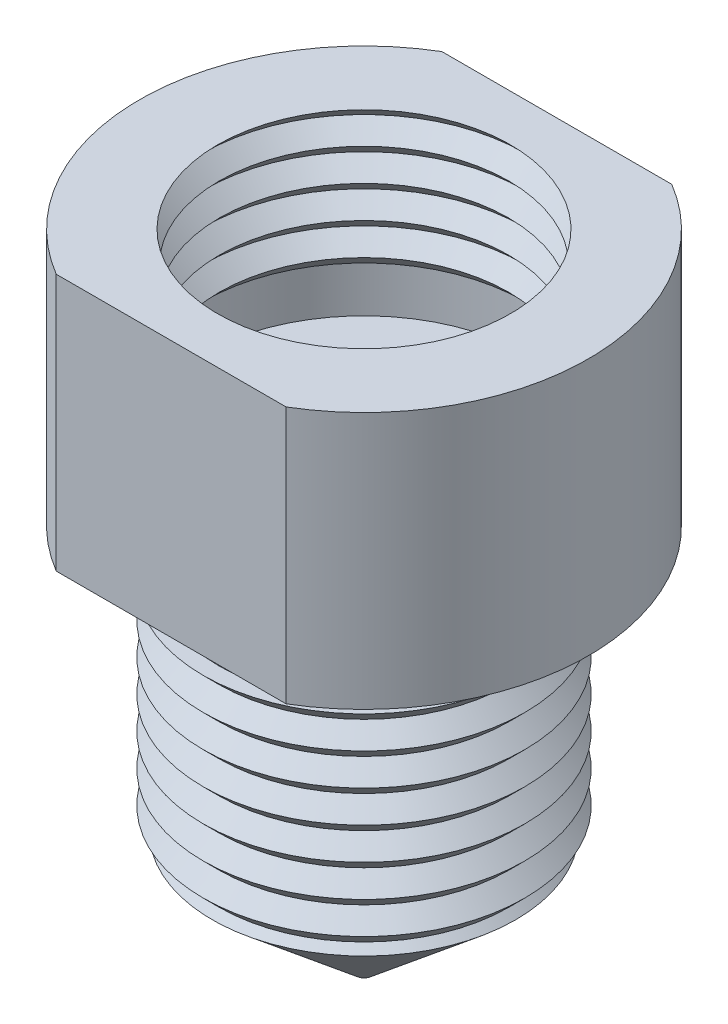
ISO-10303-21;
HEADER;
FILE_DESCRIPTION(('STEP AP214'),'2;1');
FILE_NAME('part.step','',(''),(''),'','','');
FILE_SCHEMA(('AUTOMOTIVE_DESIGN { 1 0 10303 214 1 1 1 1 }'));
ENDSEC;
DATA;
#1=APPLICATION_CONTEXT('core data for automotive mechanical design processes');
#2=APPLICATION_PROTOCOL_DEFINITION('international standard','automotive_design',2000,#1);
#3=PRODUCT_CONTEXT('',#1,'mechanical');
#4=PRODUCT('Part','Part','',(#3));
#5=PRODUCT_RELATED_PRODUCT_CATEGORY('part','',(#4));
#6=PRODUCT_DEFINITION_FORMATION('','',#4);
#7=PRODUCT_DEFINITION_CONTEXT('part definition',#1,'design');
#8=PRODUCT_DEFINITION('design','',#6,#7);
#9=PRODUCT_DEFINITION_SHAPE('','',#8);
#10=(LENGTH_UNIT() NAMED_UNIT(*) SI_UNIT(.MILLI.,.METRE.));
#11=(NAMED_UNIT(*) PLANE_ANGLE_UNIT() SI_UNIT($,.RADIAN.));
#12=(NAMED_UNIT(*) SI_UNIT($,.STERADIAN.) SOLID_ANGLE_UNIT());
#13=UNCERTAINTY_MEASURE_WITH_UNIT(LENGTH_MEASURE(1.E-05),#10,'distance_accuracy_value','');
#14=(GEOMETRIC_REPRESENTATION_CONTEXT(3) GLOBAL_UNCERTAINTY_ASSIGNED_CONTEXT((#13)) GLOBAL_UNIT_ASSIGNED_CONTEXT((#10,
#11,#12)) REPRESENTATION_CONTEXT('',''));
#15=CARTESIAN_POINT('',(0.,0.,0.));
#16=DIRECTION('',(0.,0.,1.));
#17=DIRECTION('',(1.,0.,0.));
#18=AXIS2_PLACEMENT_3D('',#15,#16,#17);
#19=CARTESIAN_POINT('',(6.985,0.,0.));
#20=DIRECTION('',(0.,-1.,0.));
#21=DIRECTION('',(1.,0.,0.));
#22=AXIS2_PLACEMENT_3D('',#19,#20,#21);
#23=PLANE('',#22);
#24=CARTESIAN_POINT('',(0.,0.,0.));
#25=DIRECTION('',(0.,1.,0.));
#26=DIRECTION('',(-1.,0.,0.));
#27=AXIS2_PLACEMENT_3D('',#24,#25,#26);
#28=CIRCLE('',#27,4.55499999999999);
#29=CARTESIAN_POINT('',(-4.55499999999999,0.,0.));
#30=VERTEX_POINT('',#29);
#31=EDGE_CURVE('E95',#30,#30,#28,.T.);
#32=ORIENTED_EDGE('',*,*,#31,.F.);
#33=EDGE_LOOP('',(#32));
#34=FACE_BOUND('',#33,.T.);
#35=DIRECTION('',(-1.,0.,0.));
#36=VECTOR('',#35,1.);
#37=CARTESIAN_POINT('',(-10.2758672415715,0.,-6.));
#38=LINE('',#37,#36);
#39=CARTESIAN_POINT('',(3.57634240530741,0.,-6.));
#40=VERTEX_POINT('',#39);
#41=CARTESIAN_POINT('',(-3.57634240530741,0.,-6.));
#42=VERTEX_POINT('',#41);
#43=EDGE_CURVE('E80',#40,#42,#38,.T.);
#44=ORIENTED_EDGE('',*,*,#43,.T.);
#45=CARTESIAN_POINT('',(0.,0.,0.));
#46=DIRECTION('',(0.,1.,0.));
#47=DIRECTION('',(-1.,0.,0.));
#48=AXIS2_PLACEMENT_3D('',#45,#46,#47);
#49=CIRCLE('',#48,6.985);
#50=CARTESIAN_POINT('',(-3.57634240530741,0.,6.));
#51=VERTEX_POINT('',#50);
#52=EDGE_CURVE('E87',#42,#51,#49,.T.);
#53=ORIENTED_EDGE('',*,*,#52,.T.);
#54=DIRECTION('',(1.,0.,0.));
#55=VECTOR('',#54,1.);
#56=CARTESIAN_POINT('',(-10.2758672415715,0.,6.));
#57=LINE('',#56,#55);
#58=CARTESIAN_POINT('',(3.57634240530741,0.,6.));
#59=VERTEX_POINT('',#58);
#60=EDGE_CURVE('E72',#51,#59,#57,.T.);
#61=ORIENTED_EDGE('',*,*,#60,.T.);
#62=EDGE_CURVE('E92',#59,#40,#49,.T.);
#63=ORIENTED_EDGE('',*,*,#62,.T.);
#64=EDGE_LOOP('',(#44,#53,#61,#63));
#65=FACE_BOUND('',#64,.T.);
#66=ADVANCED_FACE('F34',(#34,#65),#23,.F.);
#67=CARTESIAN_POINT('',(0.,0.,0.));
#68=DIRECTION('',(0.,1.,0.));
#69=DIRECTION('',(-1.,0.,0.));
#70=AXIS2_PLACEMENT_3D('',#67,#68,#69);
#71=CYLINDRICAL_SURFACE('',#70,6.985);
#72=DIRECTION('',(0.,1.,0.));
#73=VECTOR('',#72,1.);
#74=CARTESIAN_POINT('',(-3.57634240530741,0.,-6.));
#75=LINE('',#74,#73);
#76=CARTESIAN_POINT('',(-3.57634240530741,-8.001,-6.));
#77=VERTEX_POINT('',#76);
#78=EDGE_CURVE('E144',#77,#42,#75,.T.);
#79=ORIENTED_EDGE('',*,*,#78,.F.);
#80=CARTESIAN_POINT('',(0.,-8.001,0.));
#81=DIRECTION('',(0.,1.,0.));
#82=DIRECTION('',(-1.,0.,0.));
#83=AXIS2_PLACEMENT_3D('',#80,#81,#82);
#84=CIRCLE('',#83,6.985);
#85=CARTESIAN_POINT('',(-3.57634240530741,-8.001,6.));
#86=VERTEX_POINT('',#85);
#87=EDGE_CURVE('E89',#77,#86,#84,.T.);
#88=ORIENTED_EDGE('',*,*,#87,.T.);
#89=DIRECTION('',(0.,1.,0.));
#90=VECTOR('',#89,1.);
#91=CARTESIAN_POINT('',(-3.57634240530741,0.,6.));
#92=LINE('',#91,#90);
#93=EDGE_CURVE('E56',#51,#86,#92,.F.);
#94=ORIENTED_EDGE('',*,*,#93,.F.);
#95=ORIENTED_EDGE('',*,*,#52,.F.);
#96=EDGE_LOOP('',(#79,#88,#94,#95));
#97=FACE_BOUND('',#96,.T.);
#98=ADVANCED_FACE('F86',(#97),#71,.T.);
#99=DIRECTION('',(0.,1.,0.));
#100=VECTOR('',#99,1.);
#101=CARTESIAN_POINT('',(3.57634240530741,0.,-6.));
#102=LINE('',#101,#100);
#103=CARTESIAN_POINT('',(3.57634240530741,-8.001,-6.));
#104=VERTEX_POINT('',#103);
#105=EDGE_CURVE('E48',#40,#104,#102,.F.);
#106=ORIENTED_EDGE('',*,*,#105,.F.);
#107=ORIENTED_EDGE('',*,*,#62,.F.);
#108=DIRECTION('',(0.,1.,0.));
#109=VECTOR('',#108,1.);
#110=CARTESIAN_POINT('',(3.57634240530741,0.,6.));
#111=LINE('',#110,#109);
#112=CARTESIAN_POINT('',(3.57634240530741,-8.001,6.));
#113=VERTEX_POINT('',#112);
#114=EDGE_CURVE('E75',#113,#59,#111,.T.);
#115=ORIENTED_EDGE('',*,*,#114,.F.);
#116=EDGE_CURVE('E93',#113,#104,#84,.T.);
#117=ORIENTED_EDGE('',*,*,#116,.T.);
#118=EDGE_LOOP('',(#106,#107,#115,#117));
#119=FACE_BOUND('',#118,.T.);
#120=ADVANCED_FACE('F140',(#119),#71,.T.);
#121=CARTESIAN_POINT('',(4.5,-8.001,0.));
#122=DIRECTION('',(0.,1.,0.));
#123=DIRECTION('',(-1.,0.,0.));
#124=AXIS2_PLACEMENT_3D('',#121,#122,#123);
#125=PLANE('',#124);
#126=CARTESIAN_POINT('',(0.,-8.001,0.));
#127=DIRECTION('',(0.,1.,0.));
#128=DIRECTION('',(-1.,0.,0.));
#129=AXIS2_PLACEMENT_3D('',#126,#127,#128);
#130=CIRCLE('',#129,4.5);
#131=CARTESIAN_POINT('',(-4.5,-8.001,0.));
#132=VERTEX_POINT('',#131);
#133=EDGE_CURVE('E204',#132,#132,#130,.T.);
#134=ORIENTED_EDGE('',*,*,#133,.T.);
#135=EDGE_LOOP('',(#134));
#136=FACE_BOUND('',#135,.T.);
#137=DIRECTION('',(-1.,0.,0.));
#138=VECTOR('',#137,1.);
#139=CARTESIAN_POINT('',(4.5,-8.001,-6.));
#140=LINE('',#139,#138);
#141=EDGE_CURVE('E12',#104,#77,#140,.T.);
#142=ORIENTED_EDGE('',*,*,#141,.F.);
#143=ORIENTED_EDGE('',*,*,#116,.F.);
#144=DIRECTION('',(1.,0.,0.));
#145=VECTOR('',#144,1.);
#146=CARTESIAN_POINT('',(4.5,-8.001,6.));
#147=LINE('',#146,#145);
#148=EDGE_CURVE('E42',#86,#113,#147,.T.);
#149=ORIENTED_EDGE('',*,*,#148,.F.);
#150=ORIENTED_EDGE('',*,*,#87,.F.);
#151=EDGE_LOOP('',(#142,#143,#149,#150));
#152=FACE_BOUND('',#151,.T.);
#153=ADVANCED_FACE('F142',(#136,#152),#125,.F.);
#154=CARTESIAN_POINT('',(0.,0.,0.));
#155=DIRECTION('',(0.,1.,0.));
#156=DIRECTION('',(-1.,0.,0.));
#157=AXIS2_PLACEMENT_3D('',#154,#155,#156);
#158=CYLINDRICAL_SURFACE('',#157,1.5875);
#159=CARTESIAN_POINT('',(0.,-17.9060295699052,0.));
#160=DIRECTION('',(0.,1.,0.));
#161=DIRECTION('',(-1.,0.,0.));
#162=AXIS2_PLACEMENT_3D('',#159,#160,#161);
#163=CIRCLE('',#162,1.5875);
#164=CARTESIAN_POINT('',(-1.5875,-17.9060295699052,0.));
#165=VERTEX_POINT('',#164);
#166=EDGE_CURVE('E145',#165,#165,#163,.T.);
#167=ORIENTED_EDGE('',*,*,#166,.F.);
#168=EDGE_LOOP('',(#167));
#169=FACE_BOUND('',#168,.T.);
#170=CARTESIAN_POINT('',(0.,-5.969,0.));
#171=DIRECTION('',(0.,1.,0.));
#172=DIRECTION('',(-1.,0.,0.));
#173=AXIS2_PLACEMENT_3D('',#170,#171,#172);
#174=CIRCLE('',#173,1.5875);
#175=CARTESIAN_POINT('',(-1.5875,-5.969,0.));
#176=VERTEX_POINT('',#175);
#177=EDGE_CURVE('E135',#176,#176,#174,.T.);
#178=ORIENTED_EDGE('',*,*,#177,.T.);
#179=EDGE_LOOP('',(#178));
#180=FACE_BOUND('',#179,.T.);
#181=ADVANCED_FACE('F36',(#169,#180),#158,.F.);
#182=CARTESIAN_POINT('',(5.1435,-5.969,0.));
#183=DIRECTION('',(0.,-1.,0.));
#184=DIRECTION('',(1.,0.,0.));
#185=AXIS2_PLACEMENT_3D('',#182,#183,#184);
#186=PLANE('',#185);
#187=ORIENTED_EDGE('',*,*,#177,.F.);
#188=EDGE_LOOP('',(#187));
#189=FACE_BOUND('',#188,.T.);
#190=CARTESIAN_POINT('',(0.,-5.969,0.));
#191=DIRECTION('',(0.,1.,0.));
#192=DIRECTION('',(-1.,0.,0.));
#193=AXIS2_PLACEMENT_3D('',#190,#191,#192);
#194=CIRCLE('',#193,5.1435);
#195=CARTESIAN_POINT('',(-5.1435,-5.969,0.));
#196=VERTEX_POINT('',#195);
#197=EDGE_CURVE('E132',#196,#196,#194,.T.);
#198=ORIENTED_EDGE('',*,*,#197,.T.);
#199=EDGE_LOOP('',(#198));
#200=FACE_BOUND('',#199,.T.);
#201=ADVANCED_FACE('F326',(#189,#200),#186,.F.);
#202=CARTESIAN_POINT('',(0.,0.,0.));
#203=DIRECTION('',(0.,1.,0.));
#204=DIRECTION('',(-1.,0.,0.));
#205=AXIS2_PLACEMENT_3D('',#202,#203,#204);
#206=CYLINDRICAL_SURFACE('',#205,5.1435);
#207=ORIENTED_EDGE('',*,*,#197,.F.);
#208=EDGE_LOOP('',(#207));
#209=FACE_BOUND('',#208,.T.);
#210=CARTESIAN_POINT('',(0.,-4.445,0.));
#211=DIRECTION('',(0.,1.,0.));
#212=DIRECTION('',(-1.,0.,0.));
#213=AXIS2_PLACEMENT_3D('',#210,#211,#212);
#214=CIRCLE('',#213,5.1435);
#215=CARTESIAN_POINT('',(-5.1435,-4.445,0.));
#216=VERTEX_POINT('',#215);
#217=EDGE_CURVE('E129',#216,#216,#214,.T.);
#218=ORIENTED_EDGE('',*,*,#217,.T.);
#219=EDGE_LOOP('',(#218));
#220=FACE_BOUND('',#219,.T.);
#221=ADVANCED_FACE('F331',(#209,#220),#206,.F.);
#222=CARTESIAN_POINT('',(5.,-4.445,0.));
#223=DIRECTION('',(0.,1.,0.));
#224=DIRECTION('',(-1.,0.,0.));
#225=AXIS2_PLACEMENT_3D('',#222,#223,#224);
#226=PLANE('',#225);
#227=ORIENTED_EDGE('',*,*,#217,.F.);
#228=EDGE_LOOP('',(#227));
#229=FACE_BOUND('',#228,.T.);
#230=CARTESIAN_POINT('',(0.,-4.445,0.));
#231=DIRECTION('',(0.,1.,0.));
#232=DIRECTION('',(-1.,0.,0.));
#233=AXIS2_PLACEMENT_3D('',#230,#231,#232);
#234=CIRCLE('',#233,5.);
#235=CARTESIAN_POINT('',(-5.,-4.445,0.));
#236=VERTEX_POINT('',#235);
#237=EDGE_CURVE('E126',#236,#236,#234,.T.);
#238=ORIENTED_EDGE('',*,*,#237,.T.);
#239=EDGE_LOOP('',(#238));
#240=FACE_BOUND('',#239,.T.);
#241=ADVANCED_FACE('F336',(#229,#240),#226,.F.);
#242=CARTESIAN_POINT('',(0.,-3.94500000000001,0.));
#243=DIRECTION('',(0.,-1.,0.));
#244=DIRECTION('',(1.,0.,0.));
#245=AXIS2_PLACEMENT_3D('',#242,#243,#244);
#246=CONICAL_SURFACE('',#245,4.5,0.78539816339746);
#247=ORIENTED_EDGE('',*,*,#237,.F.);
#248=EDGE_LOOP('',(#247));
#249=FACE_BOUND('',#248,.T.);
#250=CARTESIAN_POINT('',(0.,-3.94500000000001,0.));
#251=DIRECTION('',(0.,1.,0.));
#252=DIRECTION('',(-1.,0.,0.));
#253=AXIS2_PLACEMENT_3D('',#250,#251,#252);
#254=CIRCLE('',#253,4.5);
#255=CARTESIAN_POINT('',(-4.5,-3.94500000000001,0.));
#256=VERTEX_POINT('',#255);
#257=EDGE_CURVE('E123',#256,#256,#254,.T.);
#258=ORIENTED_EDGE('',*,*,#257,.T.);
#259=EDGE_LOOP('',(#258));
#260=FACE_BOUND('',#259,.T.);
#261=ADVANCED_FACE('F342',(#249,#260),#246,.F.);
#262=CARTESIAN_POINT('',(0.,-3.445,0.));
#263=DIRECTION('',(0.,1.,0.));
#264=DIRECTION('',(-1.,0.,0.));
#265=AXIS2_PLACEMENT_3D('',#262,#263,#264);
#266=CONICAL_SURFACE('',#265,5.,0.785398163397438);
#267=ORIENTED_EDGE('',*,*,#257,.F.);
#268=EDGE_LOOP('',(#267));
#269=FACE_BOUND('',#268,.T.);
#270=CARTESIAN_POINT('',(0.,-3.445,0.));
#271=DIRECTION('',(0.,1.,0.));
#272=DIRECTION('',(-1.,0.,0.));
#273=AXIS2_PLACEMENT_3D('',#270,#271,#272);
#274=CIRCLE('',#273,5.);
#275=CARTESIAN_POINT('',(-5.,-3.445,0.));
#276=VERTEX_POINT('',#275);
#277=EDGE_CURVE('E120',#276,#276,#274,.T.);
#278=ORIENTED_EDGE('',*,*,#277,.T.);
#279=EDGE_LOOP('',(#278));
#280=FACE_BOUND('',#279,.T.);
#281=ADVANCED_FACE('F348',(#269,#280),#266,.F.);
#282=CARTESIAN_POINT('',(0.,-2.94500000000001,0.));
#283=DIRECTION('',(0.,-1.,0.));
#284=DIRECTION('',(1.,0.,0.));
#285=AXIS2_PLACEMENT_3D('',#282,#283,#284);
#286=CONICAL_SURFACE('',#285,4.5,0.785398163397458);
#287=ORIENTED_EDGE('',*,*,#277,.F.);
#288=EDGE_LOOP('',(#287));
#289=FACE_BOUND('',#288,.T.);
#290=CARTESIAN_POINT('',(0.,-2.94500000000001,0.));
#291=DIRECTION('',(0.,1.,0.));
#292=DIRECTION('',(-1.,0.,0.));
#293=AXIS2_PLACEMENT_3D('',#290,#291,#292);
#294=CIRCLE('',#293,4.5);
#295=CARTESIAN_POINT('',(-4.5,-2.94500000000001,0.));
#296=VERTEX_POINT('',#295);
#297=EDGE_CURVE('E117',#296,#296,#294,.T.);
#298=ORIENTED_EDGE('',*,*,#297,.T.);
#299=EDGE_LOOP('',(#298));
#300=FACE_BOUND('',#299,.T.);
#301=ADVANCED_FACE('F354',(#289,#300),#286,.F.);
#302=CARTESIAN_POINT('',(0.,-2.445,0.));
#303=DIRECTION('',(0.,1.,0.));
#304=DIRECTION('',(-1.,0.,0.));
#305=AXIS2_PLACEMENT_3D('',#302,#303,#304);
#306=CONICAL_SURFACE('',#305,5.,0.785398163397438);
#307=ORIENTED_EDGE('',*,*,#297,.F.);
#308=EDGE_LOOP('',(#307));
#309=FACE_BOUND('',#308,.T.);
#310=CARTESIAN_POINT('',(0.,-2.445,0.));
#311=DIRECTION('',(0.,1.,0.));
#312=DIRECTION('',(-1.,0.,0.));
#313=AXIS2_PLACEMENT_3D('',#310,#311,#312);
#314=CIRCLE('',#313,5.);
#315=CARTESIAN_POINT('',(-5.,-2.445,0.));
#316=VERTEX_POINT('',#315);
#317=EDGE_CURVE('E114',#316,#316,#314,.T.);
#318=ORIENTED_EDGE('',*,*,#317,.T.);
#319=EDGE_LOOP('',(#318));
#320=FACE_BOUND('',#319,.T.);
#321=ADVANCED_FACE('F360',(#309,#320),#306,.F.);
#322=CARTESIAN_POINT('',(0.,-1.94500000000001,0.));
#323=DIRECTION('',(0.,-1.,0.));
#324=DIRECTION('',(1.,0.,0.));
#325=AXIS2_PLACEMENT_3D('',#322,#323,#324);
#326=CONICAL_SURFACE('',#325,4.5,0.78539816339746);
#327=ORIENTED_EDGE('',*,*,#317,.F.);
#328=EDGE_LOOP('',(#327));
#329=FACE_BOUND('',#328,.T.);
#330=CARTESIAN_POINT('',(0.,-1.94500000000001,0.));
#331=DIRECTION('',(0.,1.,0.));
#332=DIRECTION('',(-1.,0.,0.));
#333=AXIS2_PLACEMENT_3D('',#330,#331,#332);
#334=CIRCLE('',#333,4.5);
#335=CARTESIAN_POINT('',(-4.5,-1.94500000000001,0.));
#336=VERTEX_POINT('',#335);
#337=EDGE_CURVE('E111',#336,#336,#334,.T.);
#338=ORIENTED_EDGE('',*,*,#337,.T.);
#339=EDGE_LOOP('',(#338));
#340=FACE_BOUND('',#339,.T.);
#341=ADVANCED_FACE('F366',(#329,#340),#326,.F.);
#342=CARTESIAN_POINT('',(0.,-1.445,0.));
#343=DIRECTION('',(0.,1.,0.));
#344=DIRECTION('',(-1.,0.,0.));
#345=AXIS2_PLACEMENT_3D('',#342,#343,#344);
#346=CONICAL_SURFACE('',#345,5.,0.785398163397438);
#347=ORIENTED_EDGE('',*,*,#337,.F.);
#348=EDGE_LOOP('',(#347));
#349=FACE_BOUND('',#348,.T.);
#350=CARTESIAN_POINT('',(0.,-1.445,0.));
#351=DIRECTION('',(0.,1.,0.));
#352=DIRECTION('',(-1.,0.,0.));
#353=AXIS2_PLACEMENT_3D('',#350,#351,#352);
#354=CIRCLE('',#353,5.);
#355=CARTESIAN_POINT('',(-5.,-1.445,0.));
#356=VERTEX_POINT('',#355);
#357=EDGE_CURVE('E108',#356,#356,#354,.T.);
#358=ORIENTED_EDGE('',*,*,#357,.T.);
#359=EDGE_LOOP('',(#358));
#360=FACE_BOUND('',#359,.T.);
#361=ADVANCED_FACE('F372',(#349,#360),#346,.F.);
#362=CARTESIAN_POINT('',(0.,-0.945000000000014,0.));
#363=DIRECTION('',(0.,-1.,0.));
#364=DIRECTION('',(1.,0.,0.));
#365=AXIS2_PLACEMENT_3D('',#362,#363,#364);
#366=CONICAL_SURFACE('',#365,4.5,0.785398163397458);
#367=ORIENTED_EDGE('',*,*,#357,.F.);
#368=EDGE_LOOP('',(#367));
#369=FACE_BOUND('',#368,.T.);
#370=CARTESIAN_POINT('',(0.,-0.945000000000014,0.));
#371=DIRECTION('',(0.,1.,0.));
#372=DIRECTION('',(-1.,0.,0.));
#373=AXIS2_PLACEMENT_3D('',#370,#371,#372);
#374=CIRCLE('',#373,4.5);
#375=CARTESIAN_POINT('',(-4.5,-0.945000000000014,0.));
#376=VERTEX_POINT('',#375);
#377=EDGE_CURVE('E105',#376,#376,#374,.T.);
#378=ORIENTED_EDGE('',*,*,#377,.T.);
#379=EDGE_LOOP('',(#378));
#380=FACE_BOUND('',#379,.T.);
#381=ADVANCED_FACE('F378',(#369,#380),#366,.F.);
#382=CARTESIAN_POINT('',(0.,-0.445000000000004,0.));
#383=DIRECTION('',(0.,1.,0.));
#384=DIRECTION('',(-1.,0.,0.));
#385=AXIS2_PLACEMENT_3D('',#382,#383,#384);
#386=CONICAL_SURFACE('',#385,5.,0.785398163397438);
#387=ORIENTED_EDGE('',*,*,#377,.F.);
#388=EDGE_LOOP('',(#387));
#389=FACE_BOUND('',#388,.T.);
#390=CARTESIAN_POINT('',(0.,-0.445000000000004,0.));
#391=DIRECTION('',(0.,1.,0.));
#392=DIRECTION('',(-1.,0.,0.));
#393=AXIS2_PLACEMENT_3D('',#390,#391,#392);
#394=CIRCLE('',#393,5.);
#395=CARTESIAN_POINT('',(-5.,-0.445000000000005,0.));
#396=VERTEX_POINT('',#395);
#397=EDGE_CURVE('E102',#396,#396,#394,.T.);
#398=ORIENTED_EDGE('',*,*,#397,.T.);
#399=EDGE_LOOP('',(#398));
#400=FACE_BOUND('',#399,.T.);
#401=ADVANCED_FACE('F384',(#389,#400),#386,.F.);
#402=CARTESIAN_POINT('',(0.,0.,0.));
#403=DIRECTION('',(0.,-1.,0.));
#404=DIRECTION('',(1.,0.,0.));
#405=AXIS2_PLACEMENT_3D('',#402,#403,#404);
#406=CONICAL_SURFACE('',#405,4.55499999999999,0.785398163397459);
#407=ORIENTED_EDGE('',*,*,#397,.F.);
#408=EDGE_LOOP('',(#407));
#409=FACE_BOUND('',#408,.T.);
#410=ORIENTED_EDGE('',*,*,#31,.T.);
#411=EDGE_LOOP('',(#410));
#412=FACE_BOUND('',#411,.T.);
#413=ADVANCED_FACE('F213',(#409,#412),#406,.F.);
#414=CARTESIAN_POINT('',(0.,0.,0.));
#415=DIRECTION('',(0.,1.,0.));
#416=DIRECTION('',(-1.,0.,0.));
#417=AXIS2_PLACEMENT_3D('',#414,#415,#416);
#418=CYLINDRICAL_SURFACE('',#417,4.5);
#419=ORIENTED_EDGE('',*,*,#133,.F.);
#420=EDGE_LOOP('',(#419));
#421=FACE_BOUND('',#420,.T.);
#422=CARTESIAN_POINT('',(0.,-9.525,0.));
#423=DIRECTION('',(0.,1.,0.));
#424=DIRECTION('',(-1.,0.,0.));
#425=AXIS2_PLACEMENT_3D('',#422,#423,#424);
#426=CIRCLE('',#425,4.5);
#427=CARTESIAN_POINT('',(-4.5,-9.525,0.));
#428=VERTEX_POINT('',#427);
#429=EDGE_CURVE('E202',#428,#428,#426,.T.);
#430=ORIENTED_EDGE('',*,*,#429,.T.);
#431=EDGE_LOOP('',(#430));
#432=FACE_BOUND('',#431,.T.);
#433=ADVANCED_FACE('F209',(#421,#432),#418,.T.);
#434=CARTESIAN_POINT('',(5.,-9.525,0.));
#435=DIRECTION('',(0.,-1.,0.));
#436=DIRECTION('',(1.,0.,0.));
#437=AXIS2_PLACEMENT_3D('',#434,#435,#436);
#438=PLANE('',#437);
#439=ORIENTED_EDGE('',*,*,#429,.F.);
#440=EDGE_LOOP('',(#439));
#441=FACE_BOUND('',#440,.T.);
#442=CARTESIAN_POINT('',(0.,-9.525,0.));
#443=DIRECTION('',(0.,1.,0.));
#444=DIRECTION('',(-1.,0.,0.));
#445=AXIS2_PLACEMENT_3D('',#442,#443,#444);
#446=CIRCLE('',#445,5.);
#447=CARTESIAN_POINT('',(-5.,-9.525,0.));
#448=VERTEX_POINT('',#447);
#449=EDGE_CURVE('E199',#448,#448,#446,.T.);
#450=ORIENTED_EDGE('',*,*,#449,.T.);
#451=EDGE_LOOP('',(#450));
#452=FACE_BOUND('',#451,.T.);
#453=ADVANCED_FACE('F212',(#441,#452),#438,.F.);
#454=CARTESIAN_POINT('',(0.,-10.025,0.));
#455=DIRECTION('',(0.,1.,0.));
#456=DIRECTION('',(-1.,0.,0.));
#457=AXIS2_PLACEMENT_3D('',#454,#455,#456);
#458=CONICAL_SURFACE('',#457,4.5,0.785398163397439);
#459=ORIENTED_EDGE('',*,*,#449,.F.);
#460=EDGE_LOOP('',(#459));
#461=FACE_BOUND('',#460,.T.);
#462=CARTESIAN_POINT('',(0.,-10.025,0.));
#463=DIRECTION('',(0.,1.,0.));
#464=DIRECTION('',(-1.,0.,0.));
#465=AXIS2_PLACEMENT_3D('',#462,#463,#464);
#466=CIRCLE('',#465,4.5);
#467=CARTESIAN_POINT('',(-4.5,-10.025,0.));
#468=VERTEX_POINT('',#467);
#469=EDGE_CURVE('E196',#468,#468,#466,.T.);
#470=ORIENTED_EDGE('',*,*,#469,.T.);
#471=EDGE_LOOP('',(#470));
#472=FACE_BOUND('',#471,.T.);
#473=ADVANCED_FACE('F219',(#461,#472),#458,.T.);
#474=CARTESIAN_POINT('',(0.,-10.525,0.));
#475=DIRECTION('',(0.,-1.,0.));
#476=DIRECTION('',(1.,0.,0.));
#477=AXIS2_PLACEMENT_3D('',#474,#475,#476);
#478=CONICAL_SURFACE('',#477,5.,0.78539816339746);
#479=ORIENTED_EDGE('',*,*,#469,.F.);
#480=EDGE_LOOP('',(#479));
#481=FACE_BOUND('',#480,.T.);
#482=CARTESIAN_POINT('',(0.,-10.525,0.));
#483=DIRECTION('',(0.,1.,0.));
#484=DIRECTION('',(-1.,0.,0.));
#485=AXIS2_PLACEMENT_3D('',#482,#483,#484);
#486=CIRCLE('',#485,5.);
#487=CARTESIAN_POINT('',(-5.,-10.525,0.));
#488=VERTEX_POINT('',#487);
#489=EDGE_CURVE('E193',#488,#488,#486,.T.);
#490=ORIENTED_EDGE('',*,*,#489,.T.);
#491=EDGE_LOOP('',(#490));
#492=FACE_BOUND('',#491,.T.);
#493=ADVANCED_FACE('F225',(#481,#492),#478,.T.);
#494=CARTESIAN_POINT('',(0.,-11.025,0.));
#495=DIRECTION('',(0.,1.,0.));
#496=DIRECTION('',(-1.,0.,0.));
#497=AXIS2_PLACEMENT_3D('',#494,#495,#496);
#498=CONICAL_SURFACE('',#497,4.5,0.78539816339744);
#499=ORIENTED_EDGE('',*,*,#489,.F.);
#500=EDGE_LOOP('',(#499));
#501=FACE_BOUND('',#500,.T.);
#502=CARTESIAN_POINT('',(0.,-11.025,0.));
#503=DIRECTION('',(0.,1.,0.));
#504=DIRECTION('',(-1.,0.,0.));
#505=AXIS2_PLACEMENT_3D('',#502,#503,#504);
#506=CIRCLE('',#505,4.5);
#507=CARTESIAN_POINT('',(-4.5,-11.025,0.));
#508=VERTEX_POINT('',#507);
#509=EDGE_CURVE('E190',#508,#508,#506,.T.);
#510=ORIENTED_EDGE('',*,*,#509,.T.);
#511=EDGE_LOOP('',(#510));
#512=FACE_BOUND('',#511,.T.);
#513=ADVANCED_FACE('F231',(#501,#512),#498,.T.);
#514=CARTESIAN_POINT('',(0.,-11.525,0.));
#515=DIRECTION('',(0.,-1.,0.));
#516=DIRECTION('',(1.,0.,0.));
#517=AXIS2_PLACEMENT_3D('',#514,#515,#516);
#518=CONICAL_SURFACE('',#517,5.,0.78539816339746);
#519=ORIENTED_EDGE('',*,*,#509,.F.);
#520=EDGE_LOOP('',(#519));
#521=FACE_BOUND('',#520,.T.);
#522=CARTESIAN_POINT('',(0.,-11.525,0.));
#523=DIRECTION('',(0.,1.,0.));
#524=DIRECTION('',(-1.,0.,0.));
#525=AXIS2_PLACEMENT_3D('',#522,#523,#524);
#526=CIRCLE('',#525,5.);
#527=CARTESIAN_POINT('',(-5.,-11.525,0.));
#528=VERTEX_POINT('',#527);
#529=EDGE_CURVE('E187',#528,#528,#526,.T.);
#530=ORIENTED_EDGE('',*,*,#529,.T.);
#531=EDGE_LOOP('',(#530));
#532=FACE_BOUND('',#531,.T.);
#533=ADVANCED_FACE('F237',(#521,#532),#518,.T.);
#534=CARTESIAN_POINT('',(0.,-12.025,0.));
#535=DIRECTION('',(0.,1.,0.));
#536=DIRECTION('',(-1.,0.,0.));
#537=AXIS2_PLACEMENT_3D('',#534,#535,#536);
#538=CONICAL_SURFACE('',#537,4.5,0.785398163397441);
#539=ORIENTED_EDGE('',*,*,#529,.F.);
#540=EDGE_LOOP('',(#539));
#541=FACE_BOUND('',#540,.T.);
#542=CARTESIAN_POINT('',(0.,-12.025,0.));
#543=DIRECTION('',(0.,1.,0.));
#544=DIRECTION('',(-1.,0.,0.));
#545=AXIS2_PLACEMENT_3D('',#542,#543,#544);
#546=CIRCLE('',#545,4.5);
#547=CARTESIAN_POINT('',(-4.5,-12.025,0.));
#548=VERTEX_POINT('',#547);
#549=EDGE_CURVE('E184',#548,#548,#546,.T.);
#550=ORIENTED_EDGE('',*,*,#549,.T.);
#551=EDGE_LOOP('',(#550));
#552=FACE_BOUND('',#551,.T.);
#553=ADVANCED_FACE('F243',(#541,#552),#538,.T.);
#554=CARTESIAN_POINT('',(0.,-12.525,0.));
#555=DIRECTION('',(0.,-1.,0.));
#556=DIRECTION('',(1.,0.,0.));
#557=AXIS2_PLACEMENT_3D('',#554,#555,#556);
#558=CONICAL_SURFACE('',#557,5.,0.78539816339746);
#559=ORIENTED_EDGE('',*,*,#549,.F.);
#560=EDGE_LOOP('',(#559));
#561=FACE_BOUND('',#560,.T.);
#562=CARTESIAN_POINT('',(0.,-12.525,0.));
#563=DIRECTION('',(0.,1.,0.));
#564=DIRECTION('',(-1.,0.,0.));
#565=AXIS2_PLACEMENT_3D('',#562,#563,#564);
#566=CIRCLE('',#565,5.);
#567=CARTESIAN_POINT('',(-5.,-12.525,0.));
#568=VERTEX_POINT('',#567);
#569=EDGE_CURVE('E181',#568,#568,#566,.T.);
#570=ORIENTED_EDGE('',*,*,#569,.T.);
#571=EDGE_LOOP('',(#570));
#572=FACE_BOUND('',#571,.T.);
#573=ADVANCED_FACE('F249',(#561,#572),#558,.T.);
#574=CARTESIAN_POINT('',(0.,-13.025,0.));
#575=DIRECTION('',(0.,1.,0.));
#576=DIRECTION('',(-1.,0.,0.));
#577=AXIS2_PLACEMENT_3D('',#574,#575,#576);
#578=CONICAL_SURFACE('',#577,4.5,0.785398163397441);
#579=ORIENTED_EDGE('',*,*,#569,.F.);
#580=EDGE_LOOP('',(#579));
#581=FACE_BOUND('',#580,.T.);
#582=CARTESIAN_POINT('',(0.,-13.025,0.));
#583=DIRECTION('',(0.,1.,0.));
#584=DIRECTION('',(-1.,0.,0.));
#585=AXIS2_PLACEMENT_3D('',#582,#583,#584);
#586=CIRCLE('',#585,4.5);
#587=CARTESIAN_POINT('',(-4.5,-13.025,0.));
#588=VERTEX_POINT('',#587);
#589=EDGE_CURVE('E178',#588,#588,#586,.T.);
#590=ORIENTED_EDGE('',*,*,#589,.T.);
#591=EDGE_LOOP('',(#590));
#592=FACE_BOUND('',#591,.T.);
#593=ADVANCED_FACE('F255',(#581,#592),#578,.T.);
#594=CARTESIAN_POINT('',(0.,-13.525,0.));
#595=DIRECTION('',(0.,-1.,0.));
#596=DIRECTION('',(1.,0.,0.));
#597=AXIS2_PLACEMENT_3D('',#594,#595,#596);
#598=CONICAL_SURFACE('',#597,5.,0.78539816339746);
#599=ORIENTED_EDGE('',*,*,#589,.F.);
#600=EDGE_LOOP('',(#599));
#601=FACE_BOUND('',#600,.T.);
#602=CARTESIAN_POINT('',(0.,-13.525,0.));
#603=DIRECTION('',(0.,1.,0.));
#604=DIRECTION('',(-1.,0.,0.));
#605=AXIS2_PLACEMENT_3D('',#602,#603,#604);
#606=CIRCLE('',#605,5.);
#607=CARTESIAN_POINT('',(-5.,-13.525,0.));
#608=VERTEX_POINT('',#607);
#609=EDGE_CURVE('E175',#608,#608,#606,.T.);
#610=ORIENTED_EDGE('',*,*,#609,.T.);
#611=EDGE_LOOP('',(#610));
#612=FACE_BOUND('',#611,.T.);
#613=ADVANCED_FACE('F261',(#601,#612),#598,.T.);
#614=CARTESIAN_POINT('',(0.,-14.025,0.));
#615=DIRECTION('',(0.,1.,0.));
#616=DIRECTION('',(-1.,0.,0.));
#617=AXIS2_PLACEMENT_3D('',#614,#615,#616);
#618=CONICAL_SURFACE('',#617,4.5,0.785398163397438);
#619=ORIENTED_EDGE('',*,*,#609,.F.);
#620=EDGE_LOOP('',(#619));
#621=FACE_BOUND('',#620,.T.);
#622=CARTESIAN_POINT('',(0.,-14.025,0.));
#623=DIRECTION('',(0.,1.,0.));
#624=DIRECTION('',(-1.,0.,0.));
#625=AXIS2_PLACEMENT_3D('',#622,#623,#624);
#626=CIRCLE('',#625,4.5);
#627=CARTESIAN_POINT('',(-4.5,-14.025,0.));
#628=VERTEX_POINT('',#627);
#629=EDGE_CURVE('E172',#628,#628,#626,.T.);
#630=ORIENTED_EDGE('',*,*,#629,.T.);
#631=EDGE_LOOP('',(#630));
#632=FACE_BOUND('',#631,.T.);
#633=ADVANCED_FACE('F267',(#621,#632),#618,.T.);
#634=CARTESIAN_POINT('',(0.,-14.525,0.));
#635=DIRECTION('',(0.,-1.,0.));
#636=DIRECTION('',(1.,0.,0.));
#637=AXIS2_PLACEMENT_3D('',#634,#635,#636);
#638=CONICAL_SURFACE('',#637,5.,0.785398163397462);
#639=ORIENTED_EDGE('',*,*,#629,.F.);
#640=EDGE_LOOP('',(#639));
#641=FACE_BOUND('',#640,.T.);
#642=CARTESIAN_POINT('',(0.,-14.525,0.));
#643=DIRECTION('',(0.,1.,0.));
#644=DIRECTION('',(-1.,0.,0.));
#645=AXIS2_PLACEMENT_3D('',#642,#643,#644);
#646=CIRCLE('',#645,5.);
#647=CARTESIAN_POINT('',(-5.,-14.525,0.));
#648=VERTEX_POINT('',#647);
#649=EDGE_CURVE('E169',#648,#648,#646,.T.);
#650=ORIENTED_EDGE('',*,*,#649,.T.);
#651=EDGE_LOOP('',(#650));
#652=FACE_BOUND('',#651,.T.);
#653=ADVANCED_FACE('F273',(#641,#652),#638,.T.);
#654=CARTESIAN_POINT('',(0.,-15.025,0.));
#655=DIRECTION('',(0.,1.,0.));
#656=DIRECTION('',(-1.,0.,0.));
#657=AXIS2_PLACEMENT_3D('',#654,#655,#656);
#658=CONICAL_SURFACE('',#657,4.5,0.785398163397438);
#659=ORIENTED_EDGE('',*,*,#649,.F.);
#660=EDGE_LOOP('',(#659));
#661=FACE_BOUND('',#660,.T.);
#662=CARTESIAN_POINT('',(0.,-15.025,0.));
#663=DIRECTION('',(0.,1.,0.));
#664=DIRECTION('',(-1.,0.,0.));
#665=AXIS2_PLACEMENT_3D('',#662,#663,#664);
#666=CIRCLE('',#665,4.5);
#667=CARTESIAN_POINT('',(-4.5,-15.025,0.));
#668=VERTEX_POINT('',#667);
#669=EDGE_CURVE('E166',#668,#668,#666,.T.);
#670=ORIENTED_EDGE('',*,*,#669,.T.);
#671=EDGE_LOOP('',(#670));
#672=FACE_BOUND('',#671,.T.);
#673=ADVANCED_FACE('F279',(#661,#672),#658,.T.);
#674=CARTESIAN_POINT('',(0.,-15.525,0.));
#675=DIRECTION('',(0.,-1.,0.));
#676=DIRECTION('',(1.,0.,0.));
#677=AXIS2_PLACEMENT_3D('',#674,#675,#676);
#678=CONICAL_SURFACE('',#677,5.,0.785398163397459);
#679=ORIENTED_EDGE('',*,*,#669,.F.);
#680=EDGE_LOOP('',(#679));
#681=FACE_BOUND('',#680,.T.);
#682=CARTESIAN_POINT('',(0.,-15.525,0.));
#683=DIRECTION('',(0.,1.,0.));
#684=DIRECTION('',(-1.,0.,0.));
#685=AXIS2_PLACEMENT_3D('',#682,#683,#684);
#686=CIRCLE('',#685,5.);
#687=CARTESIAN_POINT('',(-5.,-15.525,0.));
#688=VERTEX_POINT('',#687);
#689=EDGE_CURVE('E163',#688,#688,#686,.T.);
#690=ORIENTED_EDGE('',*,*,#689,.T.);
#691=EDGE_LOOP('',(#690));
#692=FACE_BOUND('',#691,.T.);
#693=ADVANCED_FACE('F285',(#681,#692),#678,.T.);
#694=CARTESIAN_POINT('',(0.,-16.025,0.));
#695=DIRECTION('',(0.,1.,0.));
#696=DIRECTION('',(-1.,0.,0.));
#697=AXIS2_PLACEMENT_3D('',#694,#695,#696);
#698=CONICAL_SURFACE('',#697,4.5,0.785398163397438);
#699=ORIENTED_EDGE('',*,*,#689,.F.);
#700=EDGE_LOOP('',(#699));
#701=FACE_BOUND('',#700,.T.);
#702=CARTESIAN_POINT('',(0.,-16.025,0.));
#703=DIRECTION('',(0.,1.,0.));
#704=DIRECTION('',(-1.,0.,0.));
#705=AXIS2_PLACEMENT_3D('',#702,#703,#704);
#706=CIRCLE('',#705,4.5);
#707=CARTESIAN_POINT('',(-4.5,-16.025,0.));
#708=VERTEX_POINT('',#707);
#709=EDGE_CURVE('E160',#708,#708,#706,.T.);
#710=ORIENTED_EDGE('',*,*,#709,.T.);
#711=EDGE_LOOP('',(#710));
#712=FACE_BOUND('',#711,.T.);
#713=ADVANCED_FACE('F291',(#701,#712),#698,.T.);
#714=CARTESIAN_POINT('',(0.,-16.2472971287503,0.));
#715=DIRECTION('',(0.,-1.,0.));
#716=DIRECTION('',(1.,0.,0.));
#717=AXIS2_PLACEMENT_3D('',#714,#715,#716);
#718=CONICAL_SURFACE('',#717,4.72229712875034,0.785398163397456);
#719=ORIENTED_EDGE('',*,*,#709,.F.);
#720=EDGE_LOOP('',(#719));
#721=FACE_BOUND('',#720,.T.);
#722=CARTESIAN_POINT('',(0.,-16.2472971287503,0.));
#723=DIRECTION('',(0.,1.,0.));
#724=DIRECTION('',(-1.,0.,0.));
#725=AXIS2_PLACEMENT_3D('',#722,#723,#724);
#726=CIRCLE('',#725,4.72229712875034);
#727=CARTESIAN_POINT('',(-4.72229712875033,-16.2472971287503,0.));
#728=VERTEX_POINT('',#727);
#729=EDGE_CURVE('E157',#728,#728,#726,.T.);
#730=ORIENTED_EDGE('',*,*,#729,.T.);
#731=EDGE_LOOP('',(#730));
#732=FACE_BOUND('',#731,.T.);
#733=ADVANCED_FACE('F297',(#721,#732),#718,.T.);
#734=CARTESIAN_POINT('',(0.,-20.,0.));
#735=DIRECTION('',(0.,1.,0.));
#736=DIRECTION('',(-1.,0.,0.));
#737=AXIS2_PLACEMENT_3D('',#734,#735,#736);
#738=CONICAL_SURFACE('',#737,0.25,0.872664625997159);
#739=ORIENTED_EDGE('',*,*,#729,.F.);
#740=EDGE_LOOP('',(#739));
#741=FACE_BOUND('',#740,.T.);
#742=CARTESIAN_POINT('',(0.,-20.,0.));
#743=DIRECTION('',(0.,1.,0.));
#744=DIRECTION('',(-1.,0.,0.));
#745=AXIS2_PLACEMENT_3D('',#742,#743,#744);
#746=CIRCLE('',#745,0.25);
#747=CARTESIAN_POINT('',(-0.249999999999998,-20.,0.));
#748=VERTEX_POINT('',#747);
#749=EDGE_CURVE('E154',#748,#748,#746,.T.);
#750=ORIENTED_EDGE('',*,*,#749,.T.);
#751=EDGE_LOOP('',(#750));
#752=FACE_BOUND('',#751,.T.);
#753=ADVANCED_FACE('F303',(#741,#752),#738,.T.);
#754=CARTESIAN_POINT('',(0.,0.,0.));
#755=DIRECTION('',(0.,1.,0.));
#756=DIRECTION('',(-1.,0.,0.));
#757=AXIS2_PLACEMENT_3D('',#754,#755,#756);
#758=CYLINDRICAL_SURFACE('',#757,0.25);
#759=ORIENTED_EDGE('',*,*,#749,.F.);
#760=EDGE_LOOP('',(#759));
#761=FACE_BOUND('',#760,.T.);
#762=CARTESIAN_POINT('',(0.,-19.5,0.));
#763=DIRECTION('',(0.,1.,0.));
#764=DIRECTION('',(-1.,0.,0.));
#765=AXIS2_PLACEMENT_3D('',#762,#763,#764);
#766=CIRCLE('',#765,0.25);
#767=CARTESIAN_POINT('',(-0.249999999999998,-19.5,0.));
#768=VERTEX_POINT('',#767);
#769=EDGE_CURVE('E148',#768,#768,#766,.T.);
#770=ORIENTED_EDGE('',*,*,#769,.T.);
#771=EDGE_LOOP('',(#770));
#772=FACE_BOUND('',#771,.T.);
#773=ADVANCED_FACE('F309',(#761,#772),#758,.F.);
#774=CARTESIAN_POINT('',(0.,-17.9060295699052,0.));
#775=DIRECTION('',(0.,1.,0.));
#776=DIRECTION('',(-1.,0.,0.));
#777=AXIS2_PLACEMENT_3D('',#774,#775,#776);
#778=CONICAL_SURFACE('',#777,1.5875,0.698131700797733);
#779=ORIENTED_EDGE('',*,*,#769,.F.);
#780=EDGE_LOOP('',(#779));
#781=FACE_BOUND('',#780,.T.);
#782=ORIENTED_EDGE('',*,*,#166,.T.);
#783=EDGE_LOOP('',(#782));
#784=FACE_BOUND('',#783,.T.);
#785=ADVANCED_FACE('F315',(#781,#784),#778,.F.);
#786=CARTESIAN_POINT('',(-10.2758672415715,-20.,6.));
#787=DIRECTION('',(0.,0.,1.));
#788=DIRECTION('',(1.,0.,0.));
#789=AXIS2_PLACEMENT_3D('',#786,#787,#788);
#790=PLANE('',#789);
#791=ORIENTED_EDGE('',*,*,#114,.T.);
#792=ORIENTED_EDGE('',*,*,#60,.F.);
#793=ORIENTED_EDGE('',*,*,#93,.T.);
#794=ORIENTED_EDGE('',*,*,#148,.T.);
#795=EDGE_LOOP('',(#791,#792,#793,#794));
#796=FACE_BOUND('',#795,.T.);
#797=ADVANCED_FACE('F73',(#796),#790,.T.);
#798=CARTESIAN_POINT('',(-10.2758672415715,-20.,-6.));
#799=DIRECTION('',(0.,0.,-1.));
#800=DIRECTION('',(-1.,0.,0.));
#801=AXIS2_PLACEMENT_3D('',#798,#799,#800);
#802=PLANE('',#801);
#803=ORIENTED_EDGE('',*,*,#78,.T.);
#804=ORIENTED_EDGE('',*,*,#43,.F.);
#805=ORIENTED_EDGE('',*,*,#105,.T.);
#806=ORIENTED_EDGE('',*,*,#141,.T.);
#807=EDGE_LOOP('',(#803,#804,#805,#806));
#808=FACE_BOUND('',#807,.T.);
#809=ADVANCED_FACE('F143',(#808),#802,.T.);
#810=CLOSED_SHELL('',(#66,#98,#120,#153,#181,#201,#221,#241,#261,#281,#301,#321,#341,#361,#381,
#401,#413,#433,#453,#473,#493,#513,#533,#553,#573,#593,#613,#633,#653,#673,#693,#713,#733,#753,
#773,#785,#797,#809));
#811=MANIFOLD_SOLID_BREP('B2',#810);
#812=ADVANCED_BREP_SHAPE_REPRESENTATION('',(#18,#811),#14);
#813=SHAPE_DEFINITION_REPRESENTATION(#9,#812);
ENDSEC;
END-ISO-10303-21;
